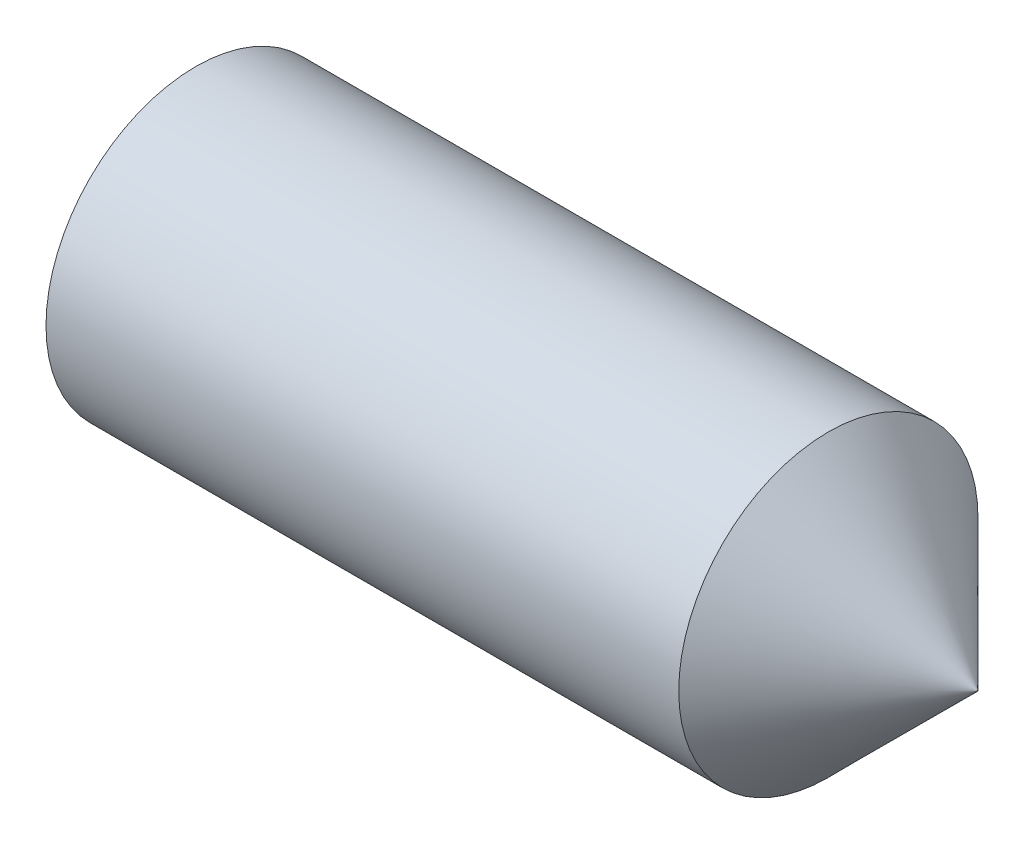
ISO-10303-21;
HEADER;
FILE_DESCRIPTION(('STEP AP214'),'2;1');
FILE_NAME('part.step','',(''),(''),'','','');
FILE_SCHEMA(('AUTOMOTIVE_DESIGN { 1 0 10303 214 1 1 1 1 }'));
ENDSEC;
DATA;
#1=APPLICATION_CONTEXT('core data for automotive mechanical design processes');
#2=APPLICATION_PROTOCOL_DEFINITION('international standard','automotive_design',2000,#1);
#3=PRODUCT_CONTEXT('',#1,'mechanical');
#4=PRODUCT('Part','Part','',(#3));
#5=PRODUCT_RELATED_PRODUCT_CATEGORY('part','',(#4));
#6=PRODUCT_DEFINITION_FORMATION('','',#4);
#7=PRODUCT_DEFINITION_CONTEXT('part definition',#1,'design');
#8=PRODUCT_DEFINITION('design','',#6,#7);
#9=PRODUCT_DEFINITION_SHAPE('','',#8);
#10=(LENGTH_UNIT() NAMED_UNIT(*) SI_UNIT(.MILLI.,.METRE.));
#11=(NAMED_UNIT(*) PLANE_ANGLE_UNIT() SI_UNIT($,.RADIAN.));
#12=(NAMED_UNIT(*) SI_UNIT($,.STERADIAN.) SOLID_ANGLE_UNIT());
#13=UNCERTAINTY_MEASURE_WITH_UNIT(LENGTH_MEASURE(1.E-05),#10,'distance_accuracy_value','');
#14=(GEOMETRIC_REPRESENTATION_CONTEXT(3) GLOBAL_UNCERTAINTY_ASSIGNED_CONTEXT((#13)) GLOBAL_UNIT_ASSIGNED_CONTEXT((#10,
#11,#12)) REPRESENTATION_CONTEXT('',''));
#15=CARTESIAN_POINT('',(0.,0.,0.));
#16=DIRECTION('',(0.,0.,1.));
#17=DIRECTION('',(1.,0.,0.));
#18=AXIS2_PLACEMENT_3D('',#15,#16,#17);
#19=CARTESIAN_POINT('',(0.,0.,0.));
#20=DIRECTION('',(-1.,0.,0.));
#21=DIRECTION('',(0.,0.,1.));
#22=AXIS2_PLACEMENT_3D('',#19,#20,#21);
#23=PLANE('',#22);
#24=CARTESIAN_POINT('',(0.,0.,0.));
#25=DIRECTION('',(-1.,0.,0.));
#26=DIRECTION('',(0.,0.,1.));
#27=AXIS2_PLACEMENT_3D('',#24,#25,#26);
#28=CIRCLE('',#27,1.2195);
#29=CARTESIAN_POINT('',(0.,0.,1.2195));
#30=VERTEX_POINT('',#29);
#31=EDGE_CURVE('E11',#30,#30,#28,.T.);
#32=ORIENTED_EDGE('',*,*,#31,.T.);
#33=EDGE_LOOP('',(#32));
#34=FACE_BOUND('',#33,.T.);
#35=DIRECTION('',(0.,0.,-1.));
#36=VECTOR('',#35,1.);
#37=CARTESIAN_POINT('',(0.,0.750000000000003,0.433012701892216));
#38=LINE('',#37,#36);
#39=CARTESIAN_POINT('',(0.,0.750000000000003,0.433012701892216));
#40=VERTEX_POINT('',#39);
#41=CARTESIAN_POINT('',(0.,0.750000000000003,-0.433012701892222));
#42=VERTEX_POINT('',#41);
#43=EDGE_CURVE('E128',#40,#42,#38,.T.);
#44=ORIENTED_EDGE('',*,*,#43,.F.);
#45=DIRECTION('',(0.,-0.866025403784439,0.5));
#46=VECTOR('',#45,1.);
#47=CARTESIAN_POINT('',(0.,0.750000000000003,0.433012701892216));
#48=LINE('',#47,#46);
#49=CARTESIAN_POINT('',(0.,0.,0.866025403784435));
#50=VERTEX_POINT('',#49);
#51=EDGE_CURVE('E50',#40,#50,#48,.T.);
#52=ORIENTED_EDGE('',*,*,#51,.T.);
#53=DIRECTION('',(0.,0.866025403784439,0.5));
#54=VECTOR('',#53,1.);
#55=CARTESIAN_POINT('',(0.,-0.749999999999996,0.433012701892216));
#56=LINE('',#55,#54);
#57=CARTESIAN_POINT('',(0.,-0.749999999999996,0.433012701892216));
#58=VERTEX_POINT('',#57);
#59=EDGE_CURVE('E119',#58,#50,#56,.T.);
#60=ORIENTED_EDGE('',*,*,#59,.F.);
#61=DIRECTION('',(0.,0.,-1.));
#62=VECTOR('',#61,1.);
#63=CARTESIAN_POINT('',(0.,-0.749999999999996,0.433012701892216));
#64=LINE('',#63,#62);
#65=CARTESIAN_POINT('',(0.,-0.749999999999996,-0.433012701892222));
#66=VERTEX_POINT('',#65);
#67=EDGE_CURVE('E122',#58,#66,#64,.T.);
#68=ORIENTED_EDGE('',*,*,#67,.T.);
#69=DIRECTION('',(0.,0.866025403784438,-0.500000000000001));
#70=VECTOR('',#69,1.);
#71=CARTESIAN_POINT('',(0.,-0.749999999999996,-0.433012701892222));
#72=LINE('',#71,#70);
#73=CARTESIAN_POINT('',(0.,0.,-0.866025403784441));
#74=VERTEX_POINT('',#73);
#75=EDGE_CURVE('E125',#66,#74,#72,.T.);
#76=ORIENTED_EDGE('',*,*,#75,.T.);
#77=DIRECTION('',(0.,-0.866025403784439,-0.5));
#78=VECTOR('',#77,1.);
#79=CARTESIAN_POINT('',(0.,0.750000000000003,-0.433012701892222));
#80=LINE('',#79,#78);
#81=EDGE_CURVE('E108',#42,#74,#80,.T.);
#82=ORIENTED_EDGE('',*,*,#81,.F.);
#83=EDGE_LOOP('',(#44,#52,#60,#68,#76,#82));
#84=FACE_BOUND('',#83,.T.);
#85=ADVANCED_FACE('F36',(#34,#84),#23,.T.);
#86=CARTESIAN_POINT('',(0.,0.,0.));
#87=DIRECTION('',(1.,0.,0.));
#88=DIRECTION('',(0.,0.,-1.));
#89=AXIS2_PLACEMENT_3D('',#86,#87,#88);
#90=CONICAL_SURFACE('',#89,1.2195,1.0471975511966);
#91=CARTESIAN_POINT('',(0.161946750507689,0.,0.));
#92=DIRECTION('',(-1.,0.,0.));
#93=DIRECTION('',(0.,0.,1.));
#94=AXIS2_PLACEMENT_3D('',#91,#92,#93);
#95=CIRCLE('',#94,1.5);
#96=CARTESIAN_POINT('',(0.161946750507689,0.,1.5));
#97=VERTEX_POINT('',#96);
#98=EDGE_CURVE('E43',#97,#97,#95,.T.);
#99=ORIENTED_EDGE('',*,*,#98,.T.);
#100=EDGE_LOOP('',(#99));
#101=FACE_BOUND('',#100,.T.);
#102=ORIENTED_EDGE('',*,*,#31,.F.);
#103=EDGE_LOOP('',(#102));
#104=FACE_BOUND('',#103,.T.);
#105=ADVANCED_FACE('F145',(#101,#104),#90,.T.);
#106=CARTESIAN_POINT('',(-12.7,0.,0.));
#107=DIRECTION('',(-1.,0.,0.));
#108=DIRECTION('',(0.,0.,1.));
#109=AXIS2_PLACEMENT_3D('',#106,#107,#108);
#110=CYLINDRICAL_SURFACE('',#109,1.5);
#111=CARTESIAN_POINT('',(6.505,0.,0.));
#112=DIRECTION('',(-1.,0.,0.));
#113=DIRECTION('',(0.,0.,1.));
#114=AXIS2_PLACEMENT_3D('',#111,#112,#113);
#115=CIRCLE('',#114,1.5);
#116=CARTESIAN_POINT('',(6.505,0.,1.5));
#117=VERTEX_POINT('',#116);
#118=EDGE_CURVE('E140',#117,#117,#115,.T.);
#119=ORIENTED_EDGE('',*,*,#118,.T.);
#120=EDGE_LOOP('',(#119));
#121=FACE_BOUND('',#120,.T.);
#122=ORIENTED_EDGE('',*,*,#98,.F.);
#123=EDGE_LOOP('',(#122));
#124=FACE_BOUND('',#123,.T.);
#125=ADVANCED_FACE('F148',(#121,#124),#110,.T.);
#126=CARTESIAN_POINT('',(8.,0.,0.));
#127=DIRECTION('',(-1.,0.,0.));
#128=DIRECTION('',(0.,0.,1.));
#129=AXIS2_PLACEMENT_3D('',#126,#127,#128);
#130=CONICAL_SURFACE('',#129,0.005,0.78539816339745);
#131=ORIENTED_EDGE('',*,*,#118,.F.);
#132=EDGE_LOOP('',(#131));
#133=FACE_BOUND('',#132,.T.);
#134=CARTESIAN_POINT('',(8.,0.,0.));
#135=DIRECTION('',(-1.,0.,0.));
#136=DIRECTION('',(0.,0.,1.));
#137=AXIS2_PLACEMENT_3D('',#134,#135,#136);
#138=CIRCLE('',#137,0.005);
#139=CARTESIAN_POINT('',(8.,0.,0.005));
#140=VERTEX_POINT('',#139);
#141=EDGE_CURVE('E137',#140,#140,#138,.T.);
#142=ORIENTED_EDGE('',*,*,#141,.T.);
#143=EDGE_LOOP('',(#142));
#144=FACE_BOUND('',#143,.T.);
#145=ADVANCED_FACE('F150',(#133,#144),#130,.T.);
#146=CARTESIAN_POINT('',(8.,0.,0.));
#147=DIRECTION('',(-1.,0.,0.));
#148=DIRECTION('',(0.,0.,1.));
#149=AXIS2_PLACEMENT_3D('',#146,#147,#148);
#150=PLANE('',#149);
#151=ORIENTED_EDGE('',*,*,#141,.F.);
#152=EDGE_LOOP('',(#151));
#153=FACE_BOUND('',#152,.T.);
#154=ADVANCED_FACE('F157',(#153),#150,.F.);
#155=CARTESIAN_POINT('',(2.1,0.750000000000003,0.433012701892216));
#156=DIRECTION('',(0.,-0.5,-0.866025403784438));
#157=DIRECTION('',(0.,0.866025403784439,-0.5));
#158=AXIS2_PLACEMENT_3D('',#155,#156,#157);
#159=PLANE('',#158);
#160=ORIENTED_EDGE('',*,*,#51,.F.);
#161=DIRECTION('',(-1.,0.,0.));
#162=VECTOR('',#161,1.);
#163=CARTESIAN_POINT('',(2.1,0.750000000000003,0.433012701892216));
#164=LINE('',#163,#162);
#165=CARTESIAN_POINT('',(2.1,0.750000000000003,0.433012701892216));
#166=VERTEX_POINT('',#165);
#167=EDGE_CURVE('E55',#166,#40,#164,.T.);
#168=ORIENTED_EDGE('',*,*,#167,.F.);
#169=DIRECTION('',(0.,-0.866025403784439,0.5));
#170=VECTOR('',#169,1.);
#171=CARTESIAN_POINT('',(2.1,0.750000000000003,0.433012701892216));
#172=LINE('',#171,#170);
#173=CARTESIAN_POINT('',(2.1,0.,0.866025403784435));
#174=VERTEX_POINT('',#173);
#175=EDGE_CURVE('E82',#166,#174,#172,.T.);
#176=ORIENTED_EDGE('',*,*,#175,.T.);
#177=DIRECTION('',(-1.,0.,0.));
#178=VECTOR('',#177,1.);
#179=CARTESIAN_POINT('',(2.1,0.,0.866025403784435));
#180=LINE('',#179,#178);
#181=EDGE_CURVE('E135',#174,#50,#180,.T.);
#182=ORIENTED_EDGE('',*,*,#181,.T.);
#183=EDGE_LOOP('',(#160,#168,#176,#182));
#184=FACE_BOUND('',#183,.T.);
#185=ADVANCED_FACE('F188',(#184),#159,.T.);
#186=CARTESIAN_POINT('',(2.1,-0.749999999999996,0.433012701892216));
#187=DIRECTION('',(0.,-0.5,0.866025403784439));
#188=DIRECTION('',(0.,-0.866025403784439,-0.5));
#189=AXIS2_PLACEMENT_3D('',#186,#187,#188);
#190=PLANE('',#189);
#191=ORIENTED_EDGE('',*,*,#59,.T.);
#192=ORIENTED_EDGE('',*,*,#181,.F.);
#193=DIRECTION('',(0.,0.866025403784439,0.5));
#194=VECTOR('',#193,1.);
#195=CARTESIAN_POINT('',(2.1,-0.749999999999996,0.433012701892216));
#196=LINE('',#195,#194);
#197=CARTESIAN_POINT('',(2.1,-0.749999999999996,0.433012701892216));
#198=VERTEX_POINT('',#197);
#199=EDGE_CURVE('E267',#198,#174,#196,.T.);
#200=ORIENTED_EDGE('',*,*,#199,.F.);
#201=DIRECTION('',(-1.,0.,0.));
#202=VECTOR('',#201,1.);
#203=CARTESIAN_POINT('',(2.1,-0.749999999999996,0.433012701892216));
#204=LINE('',#203,#202);
#205=EDGE_CURVE('E133',#198,#58,#204,.T.);
#206=ORIENTED_EDGE('',*,*,#205,.T.);
#207=EDGE_LOOP('',(#191,#192,#200,#206));
#208=FACE_BOUND('',#207,.T.);
#209=ADVANCED_FACE('F184',(#208),#190,.F.);
#210=CARTESIAN_POINT('',(2.1,-0.749999999999996,0.433012701892216));
#211=DIRECTION('',(0.,1.,0.));
#212=DIRECTION('',(0.,0.,1.));
#213=AXIS2_PLACEMENT_3D('',#210,#211,#212);
#214=PLANE('',#213);
#215=ORIENTED_EDGE('',*,*,#67,.F.);
#216=ORIENTED_EDGE('',*,*,#205,.F.);
#217=DIRECTION('',(0.,0.,-1.));
#218=VECTOR('',#217,1.);
#219=CARTESIAN_POINT('',(2.1,-0.749999999999996,0.433012701892216));
#220=LINE('',#219,#218);
#221=CARTESIAN_POINT('',(2.1,-0.749999999999996,-0.433012701892222));
#222=VERTEX_POINT('',#221);
#223=EDGE_CURVE('E103',#198,#222,#220,.T.);
#224=ORIENTED_EDGE('',*,*,#223,.T.);
#225=DIRECTION('',(-1.,0.,0.));
#226=VECTOR('',#225,1.);
#227=CARTESIAN_POINT('',(2.1,-0.749999999999996,-0.433012701892222));
#228=LINE('',#227,#226);
#229=EDGE_CURVE('E98',#222,#66,#228,.T.);
#230=ORIENTED_EDGE('',*,*,#229,.T.);
#231=EDGE_LOOP('',(#215,#216,#224,#230));
#232=FACE_BOUND('',#231,.T.);
#233=ADVANCED_FACE('F181',(#232),#214,.T.);
#234=CARTESIAN_POINT('',(2.1,-0.749999999999996,-0.433012701892222));
#235=DIRECTION('',(0.,0.500000000000001,0.866025403784438));
#236=DIRECTION('',(0.,-0.866025403784438,0.500000000000001));
#237=AXIS2_PLACEMENT_3D('',#234,#235,#236);
#238=PLANE('',#237);
#239=ORIENTED_EDGE('',*,*,#75,.F.);
#240=ORIENTED_EDGE('',*,*,#229,.F.);
#241=DIRECTION('',(0.,0.866025403784438,-0.500000000000001));
#242=VECTOR('',#241,1.);
#243=CARTESIAN_POINT('',(2.1,-0.749999999999996,-0.433012701892222));
#244=LINE('',#243,#242);
#245=CARTESIAN_POINT('',(2.1,0.,-0.866025403784441));
#246=VERTEX_POINT('',#245);
#247=EDGE_CURVE('E93',#222,#246,#244,.T.);
#248=ORIENTED_EDGE('',*,*,#247,.T.);
#249=DIRECTION('',(-1.,0.,0.));
#250=VECTOR('',#249,1.);
#251=CARTESIAN_POINT('',(2.1,0.,-0.866025403784441));
#252=LINE('',#251,#250);
#253=EDGE_CURVE('E97',#246,#74,#252,.T.);
#254=ORIENTED_EDGE('',*,*,#253,.T.);
#255=EDGE_LOOP('',(#239,#240,#248,#254));
#256=FACE_BOUND('',#255,.T.);
#257=ADVANCED_FACE('F96',(#256),#238,.T.);
#258=CARTESIAN_POINT('',(2.1,0.750000000000003,-0.433012701892222));
#259=DIRECTION('',(0.,0.5,-0.866025403784439));
#260=DIRECTION('',(0.,0.866025403784439,0.5));
#261=AXIS2_PLACEMENT_3D('',#258,#259,#260);
#262=PLANE('',#261);
#263=ORIENTED_EDGE('',*,*,#81,.T.);
#264=ORIENTED_EDGE('',*,*,#253,.F.);
#265=DIRECTION('',(0.,-0.866025403784439,-0.5));
#266=VECTOR('',#265,1.);
#267=CARTESIAN_POINT('',(2.1,0.750000000000003,-0.433012701892222));
#268=LINE('',#267,#266);
#269=CARTESIAN_POINT('',(2.1,0.750000000000003,-0.433012701892222));
#270=VERTEX_POINT('',#269);
#271=EDGE_CURVE('E102',#270,#246,#268,.T.);
#272=ORIENTED_EDGE('',*,*,#271,.F.);
#273=DIRECTION('',(-1.,0.,0.));
#274=VECTOR('',#273,1.);
#275=CARTESIAN_POINT('',(2.1,0.750000000000003,-0.433012701892222));
#276=LINE('',#275,#274);
#277=EDGE_CURVE('E78',#270,#42,#276,.T.);
#278=ORIENTED_EDGE('',*,*,#277,.T.);
#279=EDGE_LOOP('',(#263,#264,#272,#278));
#280=FACE_BOUND('',#279,.T.);
#281=ADVANCED_FACE('F105',(#280),#262,.F.);
#282=CARTESIAN_POINT('',(2.1,0.750000000000003,0.433012701892216));
#283=DIRECTION('',(0.,1.,0.));
#284=DIRECTION('',(0.,0.,1.));
#285=AXIS2_PLACEMENT_3D('',#282,#283,#284);
#286=PLANE('',#285);
#287=ORIENTED_EDGE('',*,*,#43,.T.);
#288=ORIENTED_EDGE('',*,*,#277,.F.);
#289=DIRECTION('',(0.,0.,-1.));
#290=VECTOR('',#289,1.);
#291=CARTESIAN_POINT('',(2.1,0.750000000000003,0.433012701892216));
#292=LINE('',#291,#290);
#293=EDGE_CURVE('E113',#166,#270,#292,.T.);
#294=ORIENTED_EDGE('',*,*,#293,.F.);
#295=ORIENTED_EDGE('',*,*,#167,.T.);
#296=EDGE_LOOP('',(#287,#288,#294,#295));
#297=FACE_BOUND('',#296,.T.);
#298=ADVANCED_FACE('F169',(#297),#286,.F.);
#299=CARTESIAN_POINT('',(2.1,1.5,0.));
#300=DIRECTION('',(1.,0.,0.));
#301=DIRECTION('',(0.,0.,-1.));
#302=AXIS2_PLACEMENT_3D('',#299,#300,#301);
#303=PLANE('',#302);
#304=ORIENTED_EDGE('',*,*,#175,.F.);
#305=ORIENTED_EDGE('',*,*,#293,.T.);
#306=ORIENTED_EDGE('',*,*,#271,.T.);
#307=ORIENTED_EDGE('',*,*,#247,.F.);
#308=ORIENTED_EDGE('',*,*,#223,.F.);
#309=ORIENTED_EDGE('',*,*,#199,.T.);
#310=EDGE_LOOP('',(#304,#305,#306,#307,#308,#309));
#311=FACE_BOUND('',#310,.T.);
#312=ADVANCED_FACE('F111',(#311),#303,.F.);
#313=CLOSED_SHELL('',(#85,#105,#125,#145,#154,#185,#209,#233,#257,#281,#298,#312));
#314=MANIFOLD_SOLID_BREP('B2',#313);
#315=ADVANCED_BREP_SHAPE_REPRESENTATION('',(#18,#314),#14);
#316=SHAPE_DEFINITION_REPRESENTATION(#9,#315);
ENDSEC;
END-ISO-10303-21;
